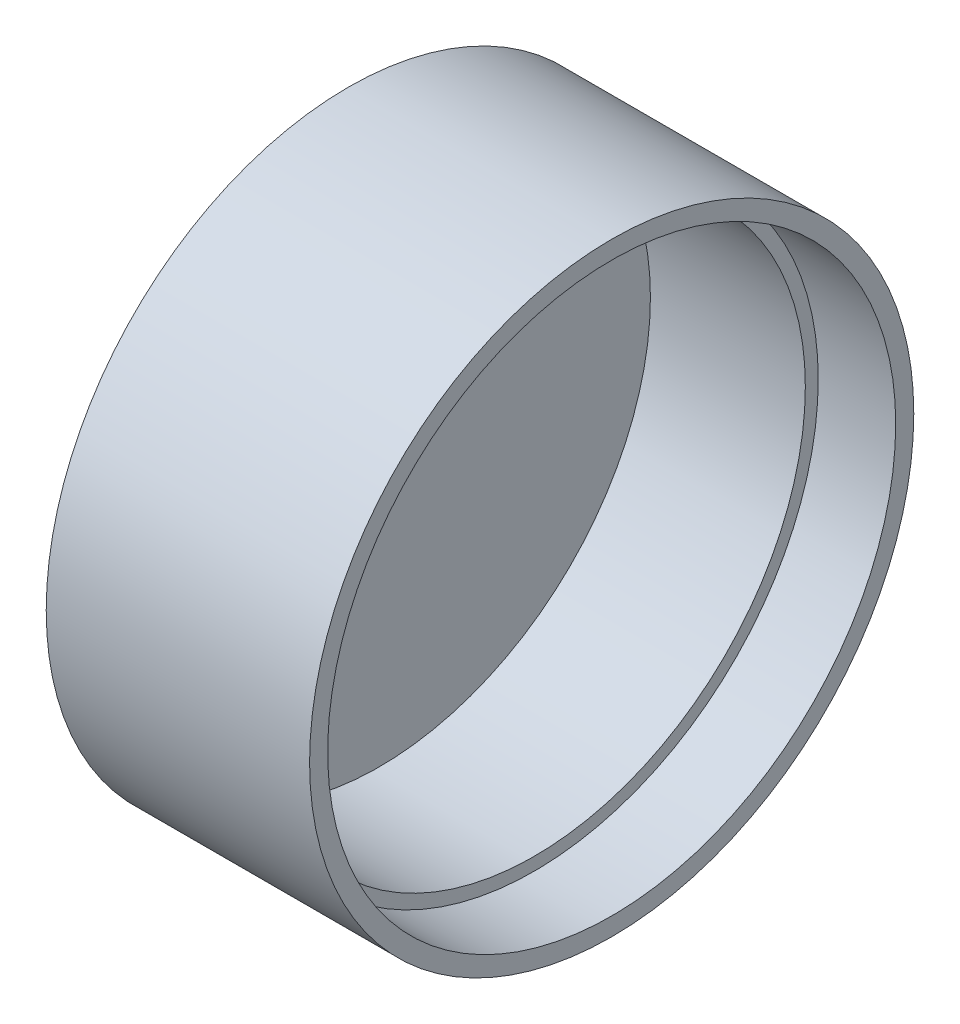
ISO-10303-21;
HEADER;
FILE_DESCRIPTION(('STEP AP214'),'2;1');
FILE_NAME('part.step','',(''),(''),'','','');
FILE_SCHEMA(('AUTOMOTIVE_DESIGN { 1 0 10303 214 1 1 1 1 }'));
ENDSEC;
DATA;
#1=APPLICATION_CONTEXT('core data for automotive mechanical design processes');
#2=APPLICATION_PROTOCOL_DEFINITION('international standard','automotive_design',2000,#1);
#3=PRODUCT_CONTEXT('',#1,'mechanical');
#4=PRODUCT('Part','Part','',(#3));
#5=PRODUCT_RELATED_PRODUCT_CATEGORY('part','',(#4));
#6=PRODUCT_DEFINITION_FORMATION('','',#4);
#7=PRODUCT_DEFINITION_CONTEXT('part definition',#1,'design');
#8=PRODUCT_DEFINITION('design','',#6,#7);
#9=PRODUCT_DEFINITION_SHAPE('','',#8);
#10=(LENGTH_UNIT() NAMED_UNIT(*) SI_UNIT(.MILLI.,.METRE.));
#11=(NAMED_UNIT(*) PLANE_ANGLE_UNIT() SI_UNIT($,.RADIAN.));
#12=(NAMED_UNIT(*) SI_UNIT($,.STERADIAN.) SOLID_ANGLE_UNIT());
#13=UNCERTAINTY_MEASURE_WITH_UNIT(LENGTH_MEASURE(1.E-05),#10,'distance_accuracy_value','');
#14=(GEOMETRIC_REPRESENTATION_CONTEXT(3) GLOBAL_UNCERTAINTY_ASSIGNED_CONTEXT((#13)) GLOBAL_UNIT_ASSIGNED_CONTEXT((#10,
#11,#12)) REPRESENTATION_CONTEXT('',''));
#15=CARTESIAN_POINT('',(0.,0.,0.));
#16=DIRECTION('',(0.,0.,1.));
#17=DIRECTION('',(1.,0.,0.));
#18=AXIS2_PLACEMENT_3D('',#15,#16,#17);
#19=CARTESIAN_POINT('',(10.2,0.,0.));
#20=DIRECTION('',(-1.,0.,0.));
#21=DIRECTION('',(0.,0.,1.));
#22=AXIS2_PLACEMENT_3D('',#19,#20,#21);
#23=CYLINDRICAL_SURFACE('',#22,11.7);
#24=CARTESIAN_POINT('',(10.2,0.,0.));
#25=DIRECTION('',(1.,0.,0.));
#26=DIRECTION('',(0.,0.,-1.));
#27=AXIS2_PLACEMENT_3D('',#24,#25,#26);
#28=CIRCLE('',#27,11.7);
#29=CARTESIAN_POINT('',(10.2,0.,-11.7));
#30=VERTEX_POINT('',#29);
#31=EDGE_CURVE('E10',#30,#30,#28,.T.);
#32=ORIENTED_EDGE('',*,*,#31,.F.);
#33=EDGE_LOOP('',(#32));
#34=FACE_BOUND('',#33,.T.);
#35=CARTESIAN_POINT('',(0.,0.,0.));
#36=DIRECTION('',(1.,0.,0.));
#37=DIRECTION('',(0.,0.,-1.));
#38=AXIS2_PLACEMENT_3D('',#35,#36,#37);
#39=CIRCLE('',#38,11.7);
#40=CARTESIAN_POINT('',(0.,0.,-11.7));
#41=VERTEX_POINT('',#40);
#42=EDGE_CURVE('E22',#41,#41,#39,.T.);
#43=ORIENTED_EDGE('',*,*,#42,.T.);
#44=EDGE_LOOP('',(#43));
#45=FACE_BOUND('',#44,.T.);
#46=ADVANCED_FACE('F15',(#34,#45),#23,.T.);
#47=CARTESIAN_POINT('',(10.2,0.,0.));
#48=DIRECTION('',(1.,0.,0.));
#49=DIRECTION('',(0.,0.,-1.));
#50=AXIS2_PLACEMENT_3D('',#47,#48,#49);
#51=PLANE('',#50);
#52=CARTESIAN_POINT('',(10.2,0.,0.));
#53=DIRECTION('',(1.,0.,0.));
#54=DIRECTION('',(0.,0.,-1.));
#55=AXIS2_PLACEMENT_3D('',#52,#53,#54);
#56=CIRCLE('',#55,11.);
#57=CARTESIAN_POINT('',(10.2,0.,-11.));
#58=VERTEX_POINT('',#57);
#59=EDGE_CURVE('E34',#58,#58,#56,.T.);
#60=ORIENTED_EDGE('',*,*,#59,.F.);
#61=EDGE_LOOP('',(#60));
#62=FACE_BOUND('',#61,.T.);
#63=ORIENTED_EDGE('',*,*,#31,.T.);
#64=EDGE_LOOP('',(#63));
#65=FACE_BOUND('',#64,.T.);
#66=ADVANCED_FACE('F40',(#62,#65),#51,.T.);
#67=CARTESIAN_POINT('',(0.,0.,0.));
#68=DIRECTION('',(1.,0.,0.));
#69=DIRECTION('',(0.,0.,-1.));
#70=AXIS2_PLACEMENT_3D('',#67,#68,#69);
#71=PLANE('',#70);
#72=ORIENTED_EDGE('',*,*,#42,.F.);
#73=EDGE_LOOP('',(#72));
#74=FACE_BOUND('',#73,.T.);
#75=ADVANCED_FACE('F42',(#74),#71,.F.);
#76=CARTESIAN_POINT('',(7.2,0.,0.));
#77=DIRECTION('',(1.,0.,0.));
#78=DIRECTION('',(0.,0.,-1.));
#79=AXIS2_PLACEMENT_3D('',#76,#77,#78);
#80=PLANE('',#79);
#81=CARTESIAN_POINT('',(7.2,0.,0.));
#82=DIRECTION('',(1.,0.,0.));
#83=DIRECTION('',(0.,0.,-1.));
#84=AXIS2_PLACEMENT_3D('',#81,#82,#83);
#85=CIRCLE('',#84,11.);
#86=CARTESIAN_POINT('',(7.2,0.,-11.));
#87=VERTEX_POINT('',#86);
#88=EDGE_CURVE('E31',#87,#87,#85,.T.);
#89=ORIENTED_EDGE('',*,*,#88,.T.);
#90=EDGE_LOOP('',(#89));
#91=FACE_BOUND('',#90,.T.);
#92=CARTESIAN_POINT('',(7.2,0.,0.));
#93=DIRECTION('',(1.,0.,0.));
#94=DIRECTION('',(0.,0.,-1.));
#95=AXIS2_PLACEMENT_3D('',#92,#93,#94);
#96=CIRCLE('',#95,10.5);
#97=CARTESIAN_POINT('',(7.2,0.,-10.5));
#98=VERTEX_POINT('',#97);
#99=EDGE_CURVE('E18',#98,#98,#96,.F.);
#100=ORIENTED_EDGE('',*,*,#99,.T.);
#101=EDGE_LOOP('',(#100));
#102=FACE_BOUND('',#101,.T.);
#103=ADVANCED_FACE('F48',(#91,#102),#80,.T.);
#104=CARTESIAN_POINT('',(7.2,0.,0.));
#105=DIRECTION('',(1.,0.,0.));
#106=DIRECTION('',(0.,0.,-1.));
#107=AXIS2_PLACEMENT_3D('',#104,#105,#106);
#108=CYLINDRICAL_SURFACE('',#107,11.);
#109=ORIENTED_EDGE('',*,*,#88,.F.);
#110=EDGE_LOOP('',(#109));
#111=FACE_BOUND('',#110,.T.);
#112=ORIENTED_EDGE('',*,*,#59,.T.);
#113=EDGE_LOOP('',(#112));
#114=FACE_BOUND('',#113,.T.);
#115=ADVANCED_FACE('F38',(#111,#114),#108,.F.);
#116=CARTESIAN_POINT('',(1.2,0.,0.));
#117=DIRECTION('',(1.,0.,0.));
#118=DIRECTION('',(0.,0.,-1.));
#119=AXIS2_PLACEMENT_3D('',#116,#117,#118);
#120=PLANE('',#119);
#121=CARTESIAN_POINT('',(1.2,0.,0.));
#122=DIRECTION('',(1.,0.,0.));
#123=DIRECTION('',(0.,0.,-1.));
#124=AXIS2_PLACEMENT_3D('',#121,#122,#123);
#125=CIRCLE('',#124,10.5);
#126=CARTESIAN_POINT('',(1.2,0.,-10.5));
#127=VERTEX_POINT('',#126);
#128=EDGE_CURVE('E26',#127,#127,#125,.F.);
#129=ORIENTED_EDGE('',*,*,#128,.F.);
#130=EDGE_LOOP('',(#129));
#131=FACE_BOUND('',#130,.T.);
#132=ADVANCED_FACE('F56',(#131),#120,.T.);
#133=CARTESIAN_POINT('',(-29.698484809835,0.,0.));
#134=DIRECTION('',(1.,0.,0.));
#135=DIRECTION('',(0.,0.,-1.));
#136=AXIS2_PLACEMENT_3D('',#133,#134,#135);
#137=CYLINDRICAL_SURFACE('',#136,10.5);
#138=ORIENTED_EDGE('',*,*,#128,.T.);
#139=EDGE_LOOP('',(#138));
#140=FACE_BOUND('',#139,.T.);
#141=ORIENTED_EDGE('',*,*,#99,.F.);
#142=EDGE_LOOP('',(#141));
#143=FACE_BOUND('',#142,.T.);
#144=ADVANCED_FACE('F53',(#140,#143),#137,.F.);
#145=CLOSED_SHELL('',(#46,#66,#75,#103,#115,#132,#144));
#146=MANIFOLD_SOLID_BREP('B1',#145);
#147=ADVANCED_BREP_SHAPE_REPRESENTATION('',(#18,#146),#14);
#148=SHAPE_DEFINITION_REPRESENTATION(#9,#147);
ENDSEC;
END-ISO-10303-21;
